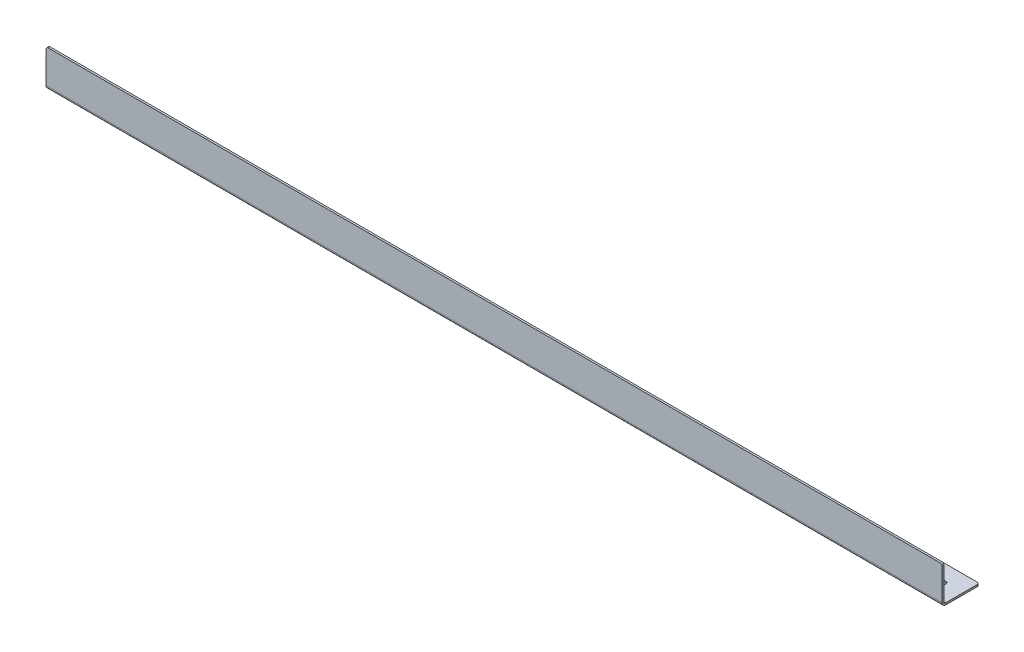
ISO-10303-21;
HEADER;
FILE_DESCRIPTION(('STEP AP214'),'2;1');
FILE_NAME('part.step','',(''),(''),'','','');
FILE_SCHEMA(('AUTOMOTIVE_DESIGN { 1 0 10303 214 1 1 1 1 }'));
ENDSEC;
DATA;
#1=APPLICATION_CONTEXT('core data for automotive mechanical design processes');
#2=APPLICATION_PROTOCOL_DEFINITION('international standard','automotive_design',2000,#1);
#3=PRODUCT_CONTEXT('',#1,'mechanical');
#4=PRODUCT('Part','Part','',(#3));
#5=PRODUCT_RELATED_PRODUCT_CATEGORY('part','',(#4));
#6=PRODUCT_DEFINITION_FORMATION('','',#4);
#7=PRODUCT_DEFINITION_CONTEXT('part definition',#1,'design');
#8=PRODUCT_DEFINITION('design','',#6,#7);
#9=PRODUCT_DEFINITION_SHAPE('','',#8);
#10=(LENGTH_UNIT() NAMED_UNIT(*) SI_UNIT(.MILLI.,.METRE.));
#11=(NAMED_UNIT(*) PLANE_ANGLE_UNIT() SI_UNIT($,.RADIAN.));
#12=(NAMED_UNIT(*) SI_UNIT($,.STERADIAN.) SOLID_ANGLE_UNIT());
#13=UNCERTAINTY_MEASURE_WITH_UNIT(LENGTH_MEASURE(1.E-05),#10,'distance_accuracy_value','');
#14=(GEOMETRIC_REPRESENTATION_CONTEXT(3) GLOBAL_UNCERTAINTY_ASSIGNED_CONTEXT((#13)) GLOBAL_UNIT_ASSIGNED_CONTEXT((#10,
#11,#12)) REPRESENTATION_CONTEXT('',''));
#15=CARTESIAN_POINT('',(0.,0.,0.));
#16=DIRECTION('',(0.,0.,1.));
#17=DIRECTION('',(1.,0.,0.));
#18=AXIS2_PLACEMENT_3D('',#15,#16,#17);
#19=CARTESIAN_POINT('',(0.,0.,0.));
#20=DIRECTION('',(0.,-1.,0.));
#21=DIRECTION('',(0.,0.,-1.));
#22=AXIS2_PLACEMENT_3D('',#19,#20,#21);
#23=PLANE('',#22);
#24=CARTESIAN_POINT('',(103.6574,0.,-33.655));
#25=DIRECTION('',(0.,-1.,0.));
#26=DIRECTION('',(0.,0.,-1.));
#27=AXIS2_PLACEMENT_3D('',#24,#25,#26);
#28=CIRCLE('',#27,3.37350099999999);
#29=CARTESIAN_POINT('',(103.6574,0.,-37.028501));
#30=VERTEX_POINT('',#29);
#31=EDGE_CURVE('E398',#30,#30,#28,.T.);
#32=ORIENTED_EDGE('',*,*,#31,.T.);
#33=EDGE_LOOP('',(#32));
#34=FACE_BOUND('',#33,.T.);
#35=CARTESIAN_POINT('',(1102.8934,0.,-33.655));
#36=DIRECTION('',(0.,-1.,0.));
#37=DIRECTION('',(0.,0.,-1.));
#38=AXIS2_PLACEMENT_3D('',#35,#36,#37);
#39=CIRCLE('',#38,3.373501);
#40=CARTESIAN_POINT('',(1102.8934,0.,-37.028501));
#41=VERTEX_POINT('',#40);
#42=EDGE_CURVE('E392',#41,#41,#39,.T.);
#43=ORIENTED_EDGE('',*,*,#42,.T.);
#44=EDGE_LOOP('',(#43));
#45=FACE_BOUND('',#44,.T.);
#46=CARTESIAN_POINT('',(1193.8,0.,-27.305));
#47=DIRECTION('',(0.,1.,0.));
#48=DIRECTION('',(0.,0.,1.));
#49=AXIS2_PLACEMENT_3D('',#46,#47,#48);
#50=CIRCLE('',#49,3.373501);
#51=CARTESIAN_POINT('',(1193.8,0.,-23.931499));
#52=VERTEX_POINT('',#51);
#53=EDGE_CURVE('E383',#52,#52,#50,.T.);
#54=ORIENTED_EDGE('',*,*,#53,.F.);
#55=EDGE_LOOP('',(#54));
#56=FACE_BOUND('',#55,.T.);
#57=DIRECTION('',(0.,0.,-1.));
#58=VECTOR('',#57,1.);
#59=CARTESIAN_POINT('',(1219.2,0.,0.));
#60=LINE('',#59,#58);
#61=CARTESIAN_POINT('',(1219.2,0.,-5.13079999999999));
#62=VERTEX_POINT('',#61);
#63=CARTESIAN_POINT('',(1219.2,0.,-47.625));
#64=VERTEX_POINT('',#63);
#65=EDGE_CURVE('E267',#62,#64,#60,.T.);
#66=ORIENTED_EDGE('',*,*,#65,.T.);
#67=CARTESIAN_POINT('',(1216.025,0.,-47.625));
#68=DIRECTION('',(0.,-1.,0.));
#69=DIRECTION('',(0.,0.,-1.));
#70=AXIS2_PLACEMENT_3D('',#67,#68,#69);
#71=CIRCLE('',#70,3.175);
#72=CARTESIAN_POINT('',(1216.025,0.,-50.8));
#73=VERTEX_POINT('',#72);
#74=EDGE_CURVE('E298',#64,#73,#71,.F.);
#75=ORIENTED_EDGE('',*,*,#74,.T.);
#76=DIRECTION('',(-1.,0.,0.));
#77=VECTOR('',#76,1.);
#78=CARTESIAN_POINT('',(-19.05,0.,-50.8));
#79=LINE('',#78,#77);
#80=CARTESIAN_POINT('',(-15.875,0.,-50.8));
#81=VERTEX_POINT('',#80);
#82=EDGE_CURVE('E270',#73,#81,#79,.T.);
#83=ORIENTED_EDGE('',*,*,#82,.T.);
#84=CARTESIAN_POINT('',(-15.875,0.,-47.625));
#85=DIRECTION('',(0.,-1.,0.));
#86=DIRECTION('',(0.,0.,-1.));
#87=AXIS2_PLACEMENT_3D('',#84,#85,#86);
#88=CIRCLE('',#87,3.175);
#89=CARTESIAN_POINT('',(-19.05,0.,-47.625));
#90=VERTEX_POINT('',#89);
#91=EDGE_CURVE('E296',#81,#90,#88,.F.);
#92=ORIENTED_EDGE('',*,*,#91,.T.);
#93=DIRECTION('',(0.,0.,1.));
#94=VECTOR('',#93,1.);
#95=CARTESIAN_POINT('',(-19.05,0.,-50.8));
#96=LINE('',#95,#94);
#97=CARTESIAN_POINT('',(-19.05,0.,-21.0122579142809));
#98=VERTEX_POINT('',#97);
#99=EDGE_CURVE('E273',#90,#98,#96,.T.);
#100=ORIENTED_EDGE('',*,*,#99,.T.);
#101=CARTESIAN_POINT('',(-15.875,0.,-21.0122579142809));
#102=DIRECTION('',(0.,-1.,0.));
#103=DIRECTION('',(0.,0.,-1.));
#104=AXIS2_PLACEMENT_3D('',#101,#102,#103);
#105=CIRCLE('',#104,3.175);
#106=CARTESIAN_POINT('',(-17.2949031657124,0.,-18.1724515828562));
#107=VERTEX_POINT('',#106);
#108=EDGE_CURVE('E294',#98,#107,#105,.F.);
#109=ORIENTED_EDGE('',*,*,#108,.T.);
#110=DIRECTION('',(0.894427190999916,0.,0.447213595499957));
#111=VECTOR('',#110,1.);
#112=CARTESIAN_POINT('',(-19.05,0.,-19.05));
#113=LINE('',#112,#111);
#114=CARTESIAN_POINT('',(-1.75509683428764,0.,-10.4025484171438));
#115=VERTEX_POINT('',#114);
#116=EDGE_CURVE('E254',#107,#115,#113,.T.);
#117=ORIENTED_EDGE('',*,*,#116,.T.);
#118=CARTESIAN_POINT('',(-3.175,0.,-7.56274208571908));
#119=DIRECTION('',(0.,-1.,0.));
#120=DIRECTION('',(0.,0.,-1.));
#121=AXIS2_PLACEMENT_3D('',#118,#119,#120);
#122=CIRCLE('',#121,3.175);
#123=CARTESIAN_POINT('',(0.,0.,-7.56274208571908));
#124=VERTEX_POINT('',#123);
#125=EDGE_CURVE('E81',#115,#124,#122,.T.);
#126=ORIENTED_EDGE('',*,*,#125,.T.);
#127=DIRECTION('',(0.,0.,1.));
#128=VECTOR('',#127,1.);
#129=CARTESIAN_POINT('',(0.,0.,0.));
#130=LINE('',#129,#128);
#131=CARTESIAN_POINT('',(0.,0.,-5.13079999999999));
#132=VERTEX_POINT('',#131);
#133=EDGE_CURVE('E249',#124,#132,#130,.T.);
#134=ORIENTED_EDGE('',*,*,#133,.T.);
#135=DIRECTION('',(1.,0.,0.));
#136=VECTOR('',#135,1.);
#137=CARTESIAN_POINT('',(1219.2,0.,-5.13079999999999));
#138=LINE('',#137,#136);
#139=EDGE_CURVE('E242',#62,#132,#138,.F.);
#140=ORIENTED_EDGE('',*,*,#139,.F.);
#141=EDGE_LOOP('',(#66,#75,#83,#92,#100,#109,#117,#126,#134,#140));
#142=FACE_BOUND('',#141,.T.);
#143=CARTESIAN_POINT('',(3.81,0.,-33.3375));
#144=DIRECTION('',(0.,1.,0.));
#145=DIRECTION('',(0.,0.,1.));
#146=AXIS2_PLACEMENT_3D('',#143,#144,#145);
#147=CIRCLE('',#146,3.37350099999999);
#148=CARTESIAN_POINT('',(3.81,0.,-29.963999));
#149=VERTEX_POINT('',#148);
#150=EDGE_CURVE('E389',#149,#149,#147,.T.);
#151=ORIENTED_EDGE('',*,*,#150,.F.);
#152=EDGE_LOOP('',(#151));
#153=FACE_BOUND('',#152,.T.);
#154=ADVANCED_FACE('F73',(#34,#45,#56,#142,#153),#23,.F.);
#155=CARTESIAN_POINT('',(1219.2,-2.5908,0.));
#156=DIRECTION('',(1.,0.,0.));
#157=DIRECTION('',(0.,0.,-1.));
#158=AXIS2_PLACEMENT_3D('',#155,#156,#157);
#159=PLANE('',#158);
#160=DIRECTION('',(0.,0.,-1.));
#161=VECTOR('',#160,1.);
#162=CARTESIAN_POINT('',(1219.2,-2.5908,0.));
#163=LINE('',#162,#161);
#164=CARTESIAN_POINT('',(1219.2,-2.59080000000001,-5.13079999999999));
#165=VERTEX_POINT('',#164);
#166=CARTESIAN_POINT('',(1219.2,-2.5908,-47.625));
#167=VERTEX_POINT('',#166);
#168=EDGE_CURVE('E253',#165,#167,#163,.T.);
#169=ORIENTED_EDGE('',*,*,#168,.T.);
#170=DIRECTION('',(0.,1.,0.));
#171=VECTOR('',#170,1.);
#172=CARTESIAN_POINT('',(1219.2,-2.5908,-47.625));
#173=LINE('',#172,#171);
#174=EDGE_CURVE('E291',#167,#64,#173,.T.);
#175=ORIENTED_EDGE('',*,*,#174,.T.);
#176=ORIENTED_EDGE('',*,*,#65,.F.);
#177=DIRECTION('',(0.,-1.,0.));
#178=VECTOR('',#177,1.);
#179=CARTESIAN_POINT('',(1219.2,0.,-5.13079999999999));
#180=LINE('',#179,#178);
#181=EDGE_CURVE('E238',#62,#165,#180,.T.);
#182=ORIENTED_EDGE('',*,*,#181,.T.);
#183=EDGE_LOOP('',(#169,#175,#176,#182));
#184=FACE_BOUND('',#183,.T.);
#185=ADVANCED_FACE('F360',(#184),#159,.T.);
#186=CARTESIAN_POINT('',(0.,-2.5908,0.));
#187=DIRECTION('',(0.,-1.,0.));
#188=DIRECTION('',(0.,0.,-1.));
#189=AXIS2_PLACEMENT_3D('',#186,#187,#188);
#190=PLANE('',#189);
#191=CARTESIAN_POINT('',(103.6574,-2.5908,-33.655));
#192=DIRECTION('',(0.,-1.,0.));
#193=DIRECTION('',(0.,0.,-1.));
#194=AXIS2_PLACEMENT_3D('',#191,#192,#193);
#195=CIRCLE('',#194,3.373501);
#196=CARTESIAN_POINT('',(103.6574,-2.5908,-37.028501));
#197=VERTEX_POINT('',#196);
#198=EDGE_CURVE('E401',#197,#197,#195,.T.);
#199=ORIENTED_EDGE('',*,*,#198,.F.);
#200=EDGE_LOOP('',(#199));
#201=FACE_BOUND('',#200,.T.);
#202=CARTESIAN_POINT('',(1102.8934,-2.5908,-33.655));
#203=DIRECTION('',(0.,-1.,0.));
#204=DIRECTION('',(0.,0.,-1.));
#205=AXIS2_PLACEMENT_3D('',#202,#203,#204);
#206=CIRCLE('',#205,3.373501);
#207=CARTESIAN_POINT('',(1102.8934,-2.5908,-37.028501));
#208=VERTEX_POINT('',#207);
#209=EDGE_CURVE('E395',#208,#208,#206,.T.);
#210=ORIENTED_EDGE('',*,*,#209,.F.);
#211=EDGE_LOOP('',(#210));
#212=FACE_BOUND('',#211,.T.);
#213=CARTESIAN_POINT('',(3.81,-2.59080000000001,-33.3375));
#214=DIRECTION('',(0.,1.,0.));
#215=DIRECTION('',(0.,0.,1.));
#216=AXIS2_PLACEMENT_3D('',#213,#214,#215);
#217=CIRCLE('',#216,3.373501);
#218=CARTESIAN_POINT('',(3.81,-2.59080000000001,-29.963999));
#219=VERTEX_POINT('',#218);
#220=EDGE_CURVE('E386',#219,#219,#217,.T.);
#221=ORIENTED_EDGE('',*,*,#220,.T.);
#222=EDGE_LOOP('',(#221));
#223=FACE_BOUND('',#222,.T.);
#224=CARTESIAN_POINT('',(1193.8,-2.59080000000001,-27.305));
#225=DIRECTION('',(0.,1.,0.));
#226=DIRECTION('',(0.,0.,1.));
#227=AXIS2_PLACEMENT_3D('',#224,#225,#226);
#228=CIRCLE('',#227,3.373501);
#229=CARTESIAN_POINT('',(1193.8,-2.59080000000001,-23.931499));
#230=VERTEX_POINT('',#229);
#231=EDGE_CURVE('E235',#230,#230,#228,.T.);
#232=ORIENTED_EDGE('',*,*,#231,.T.);
#233=EDGE_LOOP('',(#232));
#234=FACE_BOUND('',#233,.T.);
#235=DIRECTION('',(-1.,0.,0.));
#236=VECTOR('',#235,1.);
#237=CARTESIAN_POINT('',(-19.05,-2.5908,-50.8));
#238=LINE('',#237,#236);
#239=CARTESIAN_POINT('',(1216.025,-2.5908,-50.8));
#240=VERTEX_POINT('',#239);
#241=CARTESIAN_POINT('',(-15.875,-2.5908,-50.8));
#242=VERTEX_POINT('',#241);
#243=EDGE_CURVE('E257',#240,#242,#238,.T.);
#244=ORIENTED_EDGE('',*,*,#243,.F.);
#245=CARTESIAN_POINT('',(1216.025,-2.5908,-47.625));
#246=DIRECTION('',(0.,-1.,0.));
#247=DIRECTION('',(0.,0.,-1.));
#248=AXIS2_PLACEMENT_3D('',#245,#246,#247);
#249=CIRCLE('',#248,3.175);
#250=EDGE_CURVE('E308',#240,#167,#249,.T.);
#251=ORIENTED_EDGE('',*,*,#250,.T.);
#252=ORIENTED_EDGE('',*,*,#168,.F.);
#253=DIRECTION('',(1.,0.,0.));
#254=VECTOR('',#253,1.);
#255=CARTESIAN_POINT('',(1219.2,-2.59080000000001,-5.13079999999999));
#256=LINE('',#255,#254);
#257=CARTESIAN_POINT('',(0.,-2.5908,-5.13079999999999));
#258=VERTEX_POINT('',#257);
#259=EDGE_CURVE('E209',#165,#258,#256,.F.);
#260=ORIENTED_EDGE('',*,*,#259,.T.);
#261=DIRECTION('',(0.,0.,1.));
#262=VECTOR('',#261,1.);
#263=CARTESIAN_POINT('',(0.,-2.5908,0.));
#264=LINE('',#263,#262);
#265=CARTESIAN_POINT('',(0.,-2.5908,-7.56274208571908));
#266=VERTEX_POINT('',#265);
#267=EDGE_CURVE('E251',#266,#258,#264,.T.);
#268=ORIENTED_EDGE('',*,*,#267,.F.);
#269=CARTESIAN_POINT('',(-3.175,-2.5908,-7.56274208571908));
#270=DIRECTION('',(0.,-1.,0.));
#271=DIRECTION('',(0.,0.,-1.));
#272=AXIS2_PLACEMENT_3D('',#269,#270,#271);
#273=CIRCLE('',#272,3.175);
#274=CARTESIAN_POINT('',(-1.75509683428764,-2.5908,-10.4025484171438));
#275=VERTEX_POINT('',#274);
#276=EDGE_CURVE('E15',#266,#275,#273,.F.);
#277=ORIENTED_EDGE('',*,*,#276,.T.);
#278=DIRECTION('',(0.894427190999916,0.,0.447213595499957));
#279=VECTOR('',#278,1.);
#280=CARTESIAN_POINT('',(-19.05,-2.5908,-19.05));
#281=LINE('',#280,#279);
#282=CARTESIAN_POINT('',(-17.2949031657124,-2.5908,-18.1724515828562));
#283=VERTEX_POINT('',#282);
#284=EDGE_CURVE('E262',#283,#275,#281,.T.);
#285=ORIENTED_EDGE('',*,*,#284,.F.);
#286=CARTESIAN_POINT('',(-15.875,-2.5908,-21.0122579142809));
#287=DIRECTION('',(0.,-1.,0.));
#288=DIRECTION('',(0.,0.,-1.));
#289=AXIS2_PLACEMENT_3D('',#286,#287,#288);
#290=CIRCLE('',#289,3.175);
#291=CARTESIAN_POINT('',(-19.05,-2.5908,-21.0122579142809));
#292=VERTEX_POINT('',#291);
#293=EDGE_CURVE('E88',#283,#292,#290,.T.);
#294=ORIENTED_EDGE('',*,*,#293,.T.);
#295=DIRECTION('',(0.,0.,1.));
#296=VECTOR('',#295,1.);
#297=CARTESIAN_POINT('',(-19.05,-2.5908,-50.8));
#298=LINE('',#297,#296);
#299=CARTESIAN_POINT('',(-19.05,-2.5908,-47.625));
#300=VERTEX_POINT('',#299);
#301=EDGE_CURVE('E260',#300,#292,#298,.T.);
#302=ORIENTED_EDGE('',*,*,#301,.F.);
#303=CARTESIAN_POINT('',(-15.875,-2.5908,-47.625));
#304=DIRECTION('',(0.,-1.,0.));
#305=DIRECTION('',(0.,0.,-1.));
#306=AXIS2_PLACEMENT_3D('',#303,#304,#305);
#307=CIRCLE('',#306,3.175);
#308=EDGE_CURVE('E306',#300,#242,#307,.T.);
#309=ORIENTED_EDGE('',*,*,#308,.T.);
#310=EDGE_LOOP('',(#244,#251,#252,#260,#268,#277,#285,#294,#302,#309));
#311=FACE_BOUND('',#310,.T.);
#312=ADVANCED_FACE('F337',(#201,#212,#223,#234,#311),#190,.T.);
#313=CARTESIAN_POINT('',(0.,-2.5908,0.));
#314=DIRECTION('',(-1.,0.,0.));
#315=DIRECTION('',(0.,0.,1.));
#316=AXIS2_PLACEMENT_3D('',#313,#314,#315);
#317=PLANE('',#316);
#318=ORIENTED_EDGE('',*,*,#133,.F.);
#319=DIRECTION('',(0.,1.,0.));
#320=VECTOR('',#319,1.);
#321=CARTESIAN_POINT('',(0.,-2.5908,-7.56274208571908));
#322=LINE('',#321,#320);
#323=EDGE_CURVE('E322',#124,#266,#322,.F.);
#324=ORIENTED_EDGE('',*,*,#323,.T.);
#325=ORIENTED_EDGE('',*,*,#267,.T.);
#326=DIRECTION('',(0.,-1.,0.));
#327=VECTOR('',#326,1.);
#328=CARTESIAN_POINT('',(0.,0.,-5.13079999999999));
#329=LINE('',#328,#327);
#330=EDGE_CURVE('E246',#132,#258,#329,.T.);
#331=ORIENTED_EDGE('',*,*,#330,.F.);
#332=EDGE_LOOP('',(#318,#324,#325,#331));
#333=FACE_BOUND('',#332,.T.);
#334=ADVANCED_FACE('F333',(#333),#317,.T.);
#335=CARTESIAN_POINT('',(-19.05,-2.5908,-19.05));
#336=DIRECTION('',(-0.447213595499957,0.,0.894427190999916));
#337=DIRECTION('',(0.894427190999916,0.,0.447213595499957));
#338=AXIS2_PLACEMENT_3D('',#335,#336,#337);
#339=PLANE('',#338);
#340=ORIENTED_EDGE('',*,*,#116,.F.);
#341=DIRECTION('',(0.,1.,0.));
#342=VECTOR('',#341,1.);
#343=CARTESIAN_POINT('',(-17.2949031657124,-2.5908,-18.1724515828562));
#344=LINE('',#343,#342);
#345=EDGE_CURVE('E320',#107,#283,#344,.F.);
#346=ORIENTED_EDGE('',*,*,#345,.T.);
#347=ORIENTED_EDGE('',*,*,#284,.T.);
#348=DIRECTION('',(0.,1.,0.));
#349=VECTOR('',#348,1.);
#350=CARTESIAN_POINT('',(-1.75509683428764,0.,-10.4025484171438));
#351=LINE('',#350,#349);
#352=EDGE_CURVE('E317',#275,#115,#351,.T.);
#353=ORIENTED_EDGE('',*,*,#352,.T.);
#354=EDGE_LOOP('',(#340,#346,#347,#353));
#355=FACE_BOUND('',#354,.T.);
#356=ADVANCED_FACE('F339',(#355),#339,.T.);
#357=CARTESIAN_POINT('',(-19.05,-2.5908,-50.8));
#358=DIRECTION('',(-1.,0.,0.));
#359=DIRECTION('',(0.,0.,1.));
#360=AXIS2_PLACEMENT_3D('',#357,#358,#359);
#361=PLANE('',#360);
#362=ORIENTED_EDGE('',*,*,#99,.F.);
#363=DIRECTION('',(0.,1.,0.));
#364=VECTOR('',#363,1.);
#365=CARTESIAN_POINT('',(-19.05,-2.5908,-47.625));
#366=LINE('',#365,#364);
#367=EDGE_CURVE('E95',#90,#300,#366,.F.);
#368=ORIENTED_EDGE('',*,*,#367,.T.);
#369=ORIENTED_EDGE('',*,*,#301,.T.);
#370=DIRECTION('',(0.,1.,0.));
#371=VECTOR('',#370,1.);
#372=CARTESIAN_POINT('',(-19.05,-2.5908,-21.0122579142809));
#373=LINE('',#372,#371);
#374=EDGE_CURVE('E313',#292,#98,#373,.T.);
#375=ORIENTED_EDGE('',*,*,#374,.T.);
#376=EDGE_LOOP('',(#362,#368,#369,#375));
#377=FACE_BOUND('',#376,.T.);
#378=ADVANCED_FACE('F344',(#377),#361,.T.);
#379=CARTESIAN_POINT('',(-19.05,-2.5908,-50.8));
#380=DIRECTION('',(0.,0.,-1.));
#381=DIRECTION('',(-1.,0.,0.));
#382=AXIS2_PLACEMENT_3D('',#379,#380,#381);
#383=PLANE('',#382);
#384=ORIENTED_EDGE('',*,*,#82,.F.);
#385=DIRECTION('',(0.,1.,0.));
#386=VECTOR('',#385,1.);
#387=CARTESIAN_POINT('',(1216.025,-2.5908,-50.8));
#388=LINE('',#387,#386);
#389=EDGE_CURVE('E303',#73,#240,#388,.F.);
#390=ORIENTED_EDGE('',*,*,#389,.T.);
#391=ORIENTED_EDGE('',*,*,#243,.T.);
#392=DIRECTION('',(0.,1.,0.));
#393=VECTOR('',#392,1.);
#394=CARTESIAN_POINT('',(-15.875,-2.5908,-50.8));
#395=LINE('',#394,#393);
#396=EDGE_CURVE('E300',#242,#81,#395,.T.);
#397=ORIENTED_EDGE('',*,*,#396,.T.);
#398=EDGE_LOOP('',(#384,#390,#391,#397));
#399=FACE_BOUND('',#398,.T.);
#400=ADVANCED_FACE('F351',(#399),#383,.T.);
#401=CARTESIAN_POINT('',(0.,2.53999999999999,-5.13079999999999));
#402=DIRECTION('',(-1.,0.,0.));
#403=DIRECTION('',(0.,0.,1.));
#404=AXIS2_PLACEMENT_3D('',#401,#402,#403);
#405=PLANE('',#404);
#406=DIRECTION('',(0.,0.,1.));
#407=VECTOR('',#406,1.);
#408=CARTESIAN_POINT('',(0.,2.53999999999999,1.6826817716975E-13));
#409=LINE('',#408,#407);
#410=CARTESIAN_POINT('',(0.,2.53999999999998,-2.59079999999999));
#411=VERTEX_POINT('',#410);
#412=CARTESIAN_POINT('',(0.,2.53999999999997,0.));
#413=VERTEX_POINT('',#412);
#414=EDGE_CURVE('E232',#411,#413,#409,.T.);
#415=ORIENTED_EDGE('',*,*,#414,.F.);
#416=CARTESIAN_POINT('',(0.,2.53999999999999,-5.13079999999999));
#417=DIRECTION('',(1.,0.,0.));
#418=DIRECTION('',(0.,0.,-1.));
#419=AXIS2_PLACEMENT_3D('',#416,#417,#418);
#420=CIRCLE('',#419,2.54);
#421=EDGE_CURVE('E212',#132,#411,#420,.F.);
#422=ORIENTED_EDGE('',*,*,#421,.F.);
#423=ORIENTED_EDGE('',*,*,#330,.T.);
#424=CARTESIAN_POINT('',(0.,2.53999999999999,-5.13079999999999));
#425=DIRECTION('',(1.,0.,0.));
#426=DIRECTION('',(0.,0.,-1.));
#427=AXIS2_PLACEMENT_3D('',#424,#425,#426);
#428=CIRCLE('',#427,5.1308);
#429=EDGE_CURVE('E237',#258,#413,#428,.F.);
#430=ORIENTED_EDGE('',*,*,#429,.T.);
#431=EDGE_LOOP('',(#415,#422,#423,#430));
#432=FACE_BOUND('',#431,.T.);
#433=ADVANCED_FACE('F366',(#432),#405,.T.);
#434=CARTESIAN_POINT('',(1219.2,2.53999999999999,-5.13079999999999));
#435=DIRECTION('',(-1.,0.,0.));
#436=DIRECTION('',(0.,0.,1.));
#437=AXIS2_PLACEMENT_3D('',#434,#435,#436);
#438=PLANE('',#437);
#439=CARTESIAN_POINT('',(1219.2,2.53999999999999,-5.13079999999999));
#440=DIRECTION('',(1.,0.,0.));
#441=DIRECTION('',(0.,0.,-1.));
#442=AXIS2_PLACEMENT_3D('',#439,#440,#441);
#443=CIRCLE('',#442,2.54);
#444=CARTESIAN_POINT('',(1219.2,2.53999999999998,-2.59079999999999));
#445=VERTEX_POINT('',#444);
#446=EDGE_CURVE('E198',#445,#62,#443,.T.);
#447=ORIENTED_EDGE('',*,*,#446,.F.);
#448=DIRECTION('',(0.,0.,1.));
#449=VECTOR('',#448,1.);
#450=CARTESIAN_POINT('',(1219.2,2.53999999999999,-2.59079999999999));
#451=LINE('',#450,#449);
#452=CARTESIAN_POINT('',(1219.2,2.53999999999999,0.));
#453=VERTEX_POINT('',#452);
#454=EDGE_CURVE('E192',#445,#453,#451,.T.);
#455=ORIENTED_EDGE('',*,*,#454,.T.);
#456=CARTESIAN_POINT('',(1219.2,2.53999999999999,-5.13079999999999));
#457=DIRECTION('',(1.,0.,0.));
#458=DIRECTION('',(0.,0.,-1.));
#459=AXIS2_PLACEMENT_3D('',#456,#457,#458);
#460=CIRCLE('',#459,5.1308);
#461=EDGE_CURVE('E203',#453,#165,#460,.T.);
#462=ORIENTED_EDGE('',*,*,#461,.T.);
#463=ORIENTED_EDGE('',*,*,#181,.F.);
#464=EDGE_LOOP('',(#447,#455,#462,#463));
#465=FACE_BOUND('',#464,.T.);
#466=ADVANCED_FACE('F215',(#465),#438,.F.);
#467=CARTESIAN_POINT('',(1219.2,2.53999999999999,-5.13079999999999));
#468=DIRECTION('',(1.,0.,0.));
#469=DIRECTION('',(0.,0.,1.));
#470=AXIS2_PLACEMENT_3D('',#467,#468,#469);
#471=CYLINDRICAL_SURFACE('',#470,5.1308);
#472=ORIENTED_EDGE('',*,*,#259,.F.);
#473=ORIENTED_EDGE('',*,*,#461,.F.);
#474=DIRECTION('',(1.,0.,0.));
#475=VECTOR('',#474,1.);
#476=CARTESIAN_POINT('',(0.,2.53999999999999,0.));
#477=LINE('',#476,#475);
#478=EDGE_CURVE('E206',#413,#453,#477,.T.);
#479=ORIENTED_EDGE('',*,*,#478,.F.);
#480=ORIENTED_EDGE('',*,*,#429,.F.);
#481=EDGE_LOOP('',(#472,#473,#479,#480));
#482=FACE_BOUND('',#481,.T.);
#483=ADVANCED_FACE('F204',(#482),#471,.T.);
#484=CARTESIAN_POINT('',(1219.2,2.53999999999999,-5.13079999999999));
#485=DIRECTION('',(1.,0.,0.));
#486=DIRECTION('',(0.,0.,1.));
#487=AXIS2_PLACEMENT_3D('',#484,#485,#486);
#488=CYLINDRICAL_SURFACE('',#487,2.54);
#489=ORIENTED_EDGE('',*,*,#139,.T.);
#490=ORIENTED_EDGE('',*,*,#421,.T.);
#491=DIRECTION('',(-1.,0.,0.));
#492=VECTOR('',#491,1.);
#493=CARTESIAN_POINT('',(0.,2.53999999999999,-2.59079999999999));
#494=LINE('',#493,#492);
#495=EDGE_CURVE('E217',#411,#445,#494,.F.);
#496=ORIENTED_EDGE('',*,*,#495,.T.);
#497=ORIENTED_EDGE('',*,*,#446,.T.);
#498=EDGE_LOOP('',(#489,#490,#496,#497));
#499=FACE_BOUND('',#498,.T.);
#500=ADVANCED_FACE('F363',(#499),#488,.F.);
#501=CARTESIAN_POINT('',(1219.2,0.,0.));
#502=DIRECTION('',(1.,0.,0.));
#503=DIRECTION('',(0.,1.,0.));
#504=AXIS2_PLACEMENT_3D('',#501,#502,#503);
#505=PLANE('',#504);
#506=DIRECTION('',(0.,1.,0.));
#507=VECTOR('',#506,1.);
#508=CARTESIAN_POINT('',(1219.2,1.68463767698654E-11,-2.5908));
#509=LINE('',#508,#507);
#510=CARTESIAN_POINT('',(1219.2,45.0342000000001,-2.59079999999984));
#511=VERTEX_POINT('',#510);
#512=EDGE_CURVE('E375',#511,#445,#509,.F.);
#513=ORIENTED_EDGE('',*,*,#512,.F.);
#514=DIRECTION('',(0.,0.,-1.));
#515=VECTOR('',#514,1.);
#516=CARTESIAN_POINT('',(1219.2,45.0342,1.5723606890973E-13));
#517=LINE('',#516,#515);
#518=CARTESIAN_POINT('',(1219.2,45.0342,1.5723606890973E-13));
#519=VERTEX_POINT('',#518);
#520=EDGE_CURVE('E194',#511,#519,#517,.F.);
#521=ORIENTED_EDGE('',*,*,#520,.T.);
#522=DIRECTION('',(0.,-1.,0.));
#523=VECTOR('',#522,1.);
#524=CARTESIAN_POINT('',(1219.2,0.,0.));
#525=LINE('',#524,#523);
#526=EDGE_CURVE('E187',#519,#453,#525,.T.);
#527=ORIENTED_EDGE('',*,*,#526,.T.);
#528=ORIENTED_EDGE('',*,*,#454,.F.);
#529=EDGE_LOOP('',(#513,#521,#527,#528));
#530=FACE_BOUND('',#529,.T.);
#531=ADVANCED_FACE('F190',(#530),#505,.T.);
#532=CARTESIAN_POINT('',(0.,48.2092,1.6826817716975E-13));
#533=DIRECTION('',(-1.,0.,0.));
#534=DIRECTION('',(0.,0.,1.));
#535=AXIS2_PLACEMENT_3D('',#532,#533,#534);
#536=PLANE('',#535);
#537=DIRECTION('',(0.,1.,0.));
#538=VECTOR('',#537,1.);
#539=CARTESIAN_POINT('',(0.,48.2092,1.6826817716975E-13));
#540=LINE('',#539,#538);
#541=CARTESIAN_POINT('',(0.,45.0342,1.57182723918923E-13));
#542=VERTEX_POINT('',#541);
#543=EDGE_CURVE('E222',#413,#542,#540,.T.);
#544=ORIENTED_EDGE('',*,*,#543,.T.);
#545=DIRECTION('',(0.,0.,-1.));
#546=VECTOR('',#545,1.);
#547=CARTESIAN_POINT('',(0.,45.0342,1.57182723918923E-13));
#548=LINE('',#547,#546);
#549=CARTESIAN_POINT('',(0.,45.0342,-2.59079999999984));
#550=VERTEX_POINT('',#549);
#551=EDGE_CURVE('E310',#542,#550,#548,.T.);
#552=ORIENTED_EDGE('',*,*,#551,.T.);
#553=DIRECTION('',(0.,-1.,0.));
#554=VECTOR('',#553,1.);
#555=CARTESIAN_POINT('',(0.,0.,-2.5908));
#556=LINE('',#555,#554);
#557=EDGE_CURVE('E223',#411,#550,#556,.F.);
#558=ORIENTED_EDGE('',*,*,#557,.F.);
#559=ORIENTED_EDGE('',*,*,#414,.T.);
#560=EDGE_LOOP('',(#544,#552,#558,#559));
#561=FACE_BOUND('',#560,.T.);
#562=ADVANCED_FACE('F369',(#561),#536,.T.);
#563=CARTESIAN_POINT('',(0.,0.,0.));
#564=DIRECTION('',(0.,0.,1.));
#565=DIRECTION('',(0.,-1.,0.));
#566=AXIS2_PLACEMENT_3D('',#563,#564,#565);
#567=PLANE('',#566);
#568=ORIENTED_EDGE('',*,*,#526,.F.);
#569=CARTESIAN_POINT('',(1216.025,45.0342,1.57236068909729E-13));
#570=DIRECTION('',(0.,0.,1.));
#571=DIRECTION('',(0.,-1.,0.));
#572=AXIS2_PLACEMENT_3D('',#569,#570,#571);
#573=CIRCLE('',#572,3.175);
#574=CARTESIAN_POINT('',(1216.025,48.2092,1.6826817716975E-13));
#575=VERTEX_POINT('',#574);
#576=EDGE_CURVE('E289',#519,#575,#573,.T.);
#577=ORIENTED_EDGE('',*,*,#576,.T.);
#578=DIRECTION('',(1.,0.,0.));
#579=VECTOR('',#578,1.);
#580=CARTESIAN_POINT('',(1219.2,48.2092,1.6826817716975E-13));
#581=LINE('',#580,#579);
#582=CARTESIAN_POINT('',(3.17499999999993,48.2092,1.6826817716975E-13));
#583=VERTEX_POINT('',#582);
#584=EDGE_CURVE('E199',#583,#575,#581,.T.);
#585=ORIENTED_EDGE('',*,*,#584,.F.);
#586=CARTESIAN_POINT('',(3.175,45.0342,1.57236068909729E-13));
#587=DIRECTION('',(0.,0.,1.));
#588=DIRECTION('',(0.,-1.,0.));
#589=AXIS2_PLACEMENT_3D('',#586,#587,#588);
#590=CIRCLE('',#589,3.175);
#591=EDGE_CURVE('E287',#583,#542,#590,.T.);
#592=ORIENTED_EDGE('',*,*,#591,.T.);
#593=ORIENTED_EDGE('',*,*,#543,.F.);
#594=ORIENTED_EDGE('',*,*,#478,.T.);
#595=EDGE_LOOP('',(#568,#577,#585,#592,#593,#594));
#596=FACE_BOUND('',#595,.T.);
#597=ADVANCED_FACE('F220',(#596),#567,.T.);
#598=CARTESIAN_POINT('',(0.,0.,-2.5908));
#599=DIRECTION('',(0.,0.,1.));
#600=DIRECTION('',(0.,-1.,0.));
#601=AXIS2_PLACEMENT_3D('',#598,#599,#600);
#602=PLANE('',#601);
#603=DIRECTION('',(-1.,0.,0.));
#604=VECTOR('',#603,1.);
#605=CARTESIAN_POINT('',(0.,48.2092,-2.59079999999983));
#606=LINE('',#605,#604);
#607=CARTESIAN_POINT('',(3.175,48.2092,-2.59079999999983));
#608=VERTEX_POINT('',#607);
#609=CARTESIAN_POINT('',(1216.025,48.2092,-2.59079999999983));
#610=VERTEX_POINT('',#609);
#611=EDGE_CURVE('E226',#608,#610,#606,.F.);
#612=ORIENTED_EDGE('',*,*,#611,.T.);
#613=CARTESIAN_POINT('',(1216.025,45.0342,-2.59079999999984));
#614=DIRECTION('',(0.,0.,1.));
#615=DIRECTION('',(0.,-1.,0.));
#616=AXIS2_PLACEMENT_3D('',#613,#614,#615);
#617=CIRCLE('',#616,3.175);
#618=EDGE_CURVE('E284',#610,#511,#617,.F.);
#619=ORIENTED_EDGE('',*,*,#618,.T.);
#620=ORIENTED_EDGE('',*,*,#512,.T.);
#621=ORIENTED_EDGE('',*,*,#495,.F.);
#622=ORIENTED_EDGE('',*,*,#557,.T.);
#623=CARTESIAN_POINT('',(3.175,45.0342,-2.59079999999984));
#624=DIRECTION('',(0.,0.,1.));
#625=DIRECTION('',(0.,-1.,0.));
#626=AXIS2_PLACEMENT_3D('',#623,#624,#625);
#627=CIRCLE('',#626,3.175);
#628=EDGE_CURVE('E282',#550,#608,#627,.F.);
#629=ORIENTED_EDGE('',*,*,#628,.T.);
#630=EDGE_LOOP('',(#612,#619,#620,#621,#622,#629));
#631=FACE_BOUND('',#630,.T.);
#632=ADVANCED_FACE('F373',(#631),#602,.F.);
#633=CARTESIAN_POINT('',(1219.2,48.2092,1.6826817716975E-13));
#634=DIRECTION('',(0.,1.,0.));
#635=DIRECTION('',(0.,0.,1.));
#636=AXIS2_PLACEMENT_3D('',#633,#634,#635);
#637=PLANE('',#636);
#638=ORIENTED_EDGE('',*,*,#584,.T.);
#639=DIRECTION('',(0.,0.,-1.));
#640=VECTOR('',#639,1.);
#641=CARTESIAN_POINT('',(1216.025,48.2092,1.6826817716975E-13));
#642=LINE('',#641,#640);
#643=EDGE_CURVE('E279',#575,#610,#642,.T.);
#644=ORIENTED_EDGE('',*,*,#643,.T.);
#645=ORIENTED_EDGE('',*,*,#611,.F.);
#646=DIRECTION('',(0.,0.,-1.));
#647=VECTOR('',#646,1.);
#648=CARTESIAN_POINT('',(3.17499999999993,48.2092,1.6826817716975E-13));
#649=LINE('',#648,#647);
#650=EDGE_CURVE('E265',#608,#583,#649,.F.);
#651=ORIENTED_EDGE('',*,*,#650,.T.);
#652=EDGE_LOOP('',(#638,#644,#645,#651));
#653=FACE_BOUND('',#652,.T.);
#654=ADVANCED_FACE('F421',(#653),#637,.T.);
#655=CARTESIAN_POINT('',(1193.8,0.,-27.305));
#656=DIRECTION('',(0.,1.,0.));
#657=DIRECTION('',(0.,0.,1.));
#658=AXIS2_PLACEMENT_3D('',#655,#656,#657);
#659=CYLINDRICAL_SURFACE('',#658,3.373501);
#660=ORIENTED_EDGE('',*,*,#231,.F.);
#661=EDGE_LOOP('',(#660));
#662=FACE_BOUND('',#661,.T.);
#663=ORIENTED_EDGE('',*,*,#53,.T.);
#664=EDGE_LOOP('',(#663));
#665=FACE_BOUND('',#664,.T.);
#666=ADVANCED_FACE('F417',(#662,#665),#659,.F.);
#667=CARTESIAN_POINT('',(1216.025,45.0342,1.57182723918923E-13));
#668=DIRECTION('',(0.,0.,-1.));
#669=DIRECTION('',(0.,1.,0.));
#670=AXIS2_PLACEMENT_3D('',#667,#668,#669);
#671=CYLINDRICAL_SURFACE('',#670,3.175);
#672=ORIENTED_EDGE('',*,*,#576,.F.);
#673=ORIENTED_EDGE('',*,*,#520,.F.);
#674=ORIENTED_EDGE('',*,*,#618,.F.);
#675=ORIENTED_EDGE('',*,*,#643,.F.);
#676=EDGE_LOOP('',(#672,#673,#674,#675));
#677=FACE_BOUND('',#676,.T.);
#678=ADVANCED_FACE('F420',(#677),#671,.T.);
#679=CARTESIAN_POINT('',(1216.025,-2.5908,-47.625));
#680=DIRECTION('',(0.,1.,0.));
#681=DIRECTION('',(0.,0.,1.));
#682=AXIS2_PLACEMENT_3D('',#679,#680,#681);
#683=CYLINDRICAL_SURFACE('',#682,3.175);
#684=ORIENTED_EDGE('',*,*,#250,.F.);
#685=ORIENTED_EDGE('',*,*,#389,.F.);
#686=ORIENTED_EDGE('',*,*,#74,.F.);
#687=ORIENTED_EDGE('',*,*,#174,.F.);
#688=EDGE_LOOP('',(#684,#685,#686,#687));
#689=FACE_BOUND('',#688,.T.);
#690=ADVANCED_FACE('F357',(#689),#683,.T.);
#691=CARTESIAN_POINT('',(3.175,45.0342,1.57182723918923E-13));
#692=DIRECTION('',(0.,0.,-1.));
#693=DIRECTION('',(0.,1.,0.));
#694=AXIS2_PLACEMENT_3D('',#691,#692,#693);
#695=CYLINDRICAL_SURFACE('',#694,3.175);
#696=ORIENTED_EDGE('',*,*,#591,.F.);
#697=ORIENTED_EDGE('',*,*,#650,.F.);
#698=ORIENTED_EDGE('',*,*,#628,.F.);
#699=ORIENTED_EDGE('',*,*,#551,.F.);
#700=EDGE_LOOP('',(#696,#697,#698,#699));
#701=FACE_BOUND('',#700,.T.);
#702=ADVANCED_FACE('F448',(#701),#695,.T.);
#703=CARTESIAN_POINT('',(-15.875,-2.5908,-47.625));
#704=DIRECTION('',(0.,1.,0.));
#705=DIRECTION('',(0.,0.,1.));
#706=AXIS2_PLACEMENT_3D('',#703,#704,#705);
#707=CYLINDRICAL_SURFACE('',#706,3.175);
#708=ORIENTED_EDGE('',*,*,#308,.F.);
#709=ORIENTED_EDGE('',*,*,#367,.F.);
#710=ORIENTED_EDGE('',*,*,#91,.F.);
#711=ORIENTED_EDGE('',*,*,#396,.F.);
#712=EDGE_LOOP('',(#708,#709,#710,#711));
#713=FACE_BOUND('',#712,.T.);
#714=ADVANCED_FACE('F349',(#713),#707,.T.);
#715=CARTESIAN_POINT('',(-15.875,-2.5908,-21.0122579142809));
#716=DIRECTION('',(0.,1.,0.));
#717=DIRECTION('',(0.,0.,1.));
#718=AXIS2_PLACEMENT_3D('',#715,#716,#717);
#719=CYLINDRICAL_SURFACE('',#718,3.175);
#720=ORIENTED_EDGE('',*,*,#293,.F.);
#721=ORIENTED_EDGE('',*,*,#345,.F.);
#722=ORIENTED_EDGE('',*,*,#108,.F.);
#723=ORIENTED_EDGE('',*,*,#374,.F.);
#724=EDGE_LOOP('',(#720,#721,#722,#723));
#725=FACE_BOUND('',#724,.T.);
#726=ADVANCED_FACE('F342',(#725),#719,.T.);
#727=CARTESIAN_POINT('',(-3.175,-2.5908,-7.56274208571908));
#728=DIRECTION('',(0.,-1.,0.));
#729=DIRECTION('',(0.,0.,-1.));
#730=AXIS2_PLACEMENT_3D('',#727,#728,#729);
#731=CYLINDRICAL_SURFACE('',#730,3.175);
#732=ORIENTED_EDGE('',*,*,#276,.F.);
#733=ORIENTED_EDGE('',*,*,#323,.F.);
#734=ORIENTED_EDGE('',*,*,#125,.F.);
#735=ORIENTED_EDGE('',*,*,#352,.F.);
#736=EDGE_LOOP('',(#732,#733,#734,#735));
#737=FACE_BOUND('',#736,.T.);
#738=ADVANCED_FACE('F75',(#737),#731,.F.);
#739=CARTESIAN_POINT('',(3.81,0.,-33.3375));
#740=DIRECTION('',(0.,1.,0.));
#741=DIRECTION('',(0.,0.,1.));
#742=AXIS2_PLACEMENT_3D('',#739,#740,#741);
#743=CYLINDRICAL_SURFACE('',#742,3.37350099999999);
#744=ORIENTED_EDGE('',*,*,#220,.F.);
#745=EDGE_LOOP('',(#744));
#746=FACE_BOUND('',#745,.T.);
#747=ORIENTED_EDGE('',*,*,#150,.T.);
#748=EDGE_LOOP('',(#747));
#749=FACE_BOUND('',#748,.T.);
#750=ADVANCED_FACE('F457',(#746,#749),#743,.F.);
#751=CARTESIAN_POINT('',(1102.8934,-2.5908,-33.655));
#752=DIRECTION('',(0.,-1.,0.));
#753=DIRECTION('',(0.,0.,-1.));
#754=AXIS2_PLACEMENT_3D('',#751,#752,#753);
#755=CYLINDRICAL_SURFACE('',#754,3.373501);
#756=ORIENTED_EDGE('',*,*,#209,.T.);
#757=EDGE_LOOP('',(#756));
#758=FACE_BOUND('',#757,.T.);
#759=ORIENTED_EDGE('',*,*,#42,.F.);
#760=EDGE_LOOP('',(#759));
#761=FACE_BOUND('',#760,.T.);
#762=ADVANCED_FACE('F461',(#758,#761),#755,.F.);
#763=CARTESIAN_POINT('',(103.6574,-2.5908,-33.655));
#764=DIRECTION('',(0.,-1.,0.));
#765=DIRECTION('',(0.,0.,-1.));
#766=AXIS2_PLACEMENT_3D('',#763,#764,#765);
#767=CYLINDRICAL_SURFACE('',#766,3.37350099999999);
#768=ORIENTED_EDGE('',*,*,#198,.T.);
#769=EDGE_LOOP('',(#768));
#770=FACE_BOUND('',#769,.T.);
#771=ORIENTED_EDGE('',*,*,#31,.F.);
#772=EDGE_LOOP('',(#771));
#773=FACE_BOUND('',#772,.T.);
#774=ADVANCED_FACE('F405',(#770,#773),#767,.F.);
#775=CLOSED_SHELL('',(#154,#185,#312,#334,#356,#378,#400,#433,#466,#483,#500,#531,#562,#597,
#632,#654,#666,#678,#690,#702,#714,#726,#738,#750,#762,#774));
#776=MANIFOLD_SOLID_BREP('B2',#775);
#777=ADVANCED_BREP_SHAPE_REPRESENTATION('',(#18,#776),#14);
#778=SHAPE_DEFINITION_REPRESENTATION(#9,#777);
ENDSEC;
END-ISO-10303-21;
